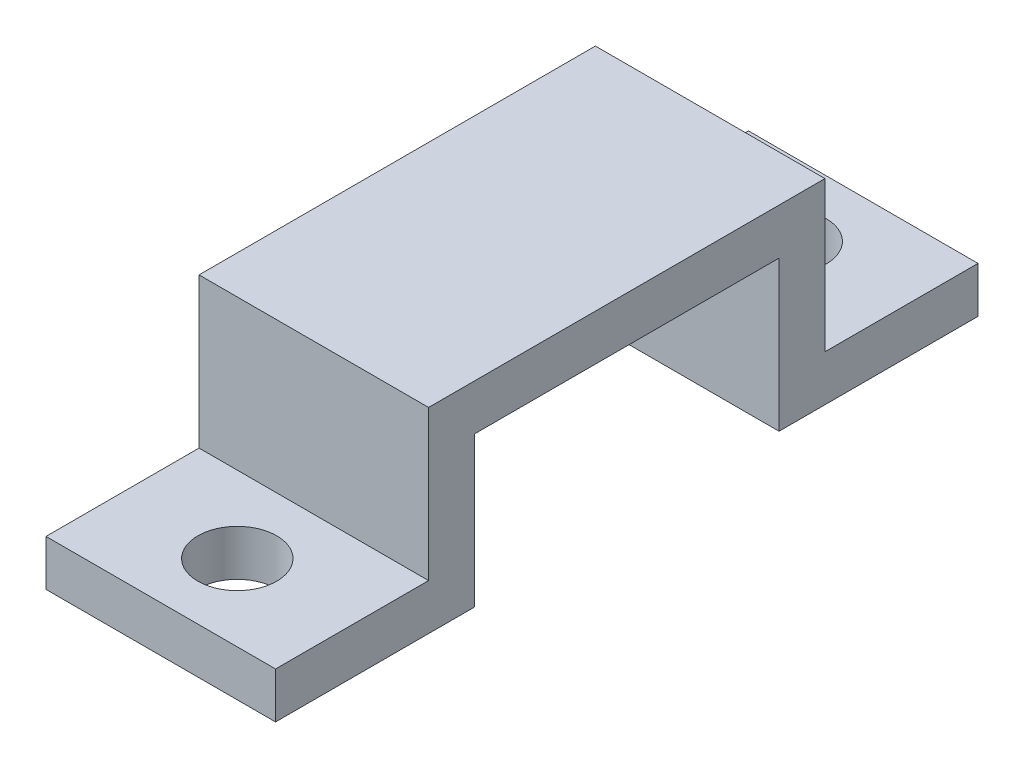
ISO-10303-21;
HEADER;
FILE_DESCRIPTION(('STEP AP214'),'2;1');
FILE_NAME('part.step','',(''),(''),'','','');
FILE_SCHEMA(('AUTOMOTIVE_DESIGN { 1 0 10303 214 1 1 1 1 }'));
ENDSEC;
DATA;
#1=APPLICATION_CONTEXT('core data for automotive mechanical design processes');
#2=APPLICATION_PROTOCOL_DEFINITION('international standard','automotive_design',2000,#1);
#3=PRODUCT_CONTEXT('',#1,'mechanical');
#4=PRODUCT('Part','Part','',(#3));
#5=PRODUCT_RELATED_PRODUCT_CATEGORY('part','',(#4));
#6=PRODUCT_DEFINITION_FORMATION('','',#4);
#7=PRODUCT_DEFINITION_CONTEXT('part definition',#1,'design');
#8=PRODUCT_DEFINITION('design','',#6,#7);
#9=PRODUCT_DEFINITION_SHAPE('','',#8);
#10=(LENGTH_UNIT() NAMED_UNIT(*) SI_UNIT(.MILLI.,.METRE.));
#11=(NAMED_UNIT(*) PLANE_ANGLE_UNIT() SI_UNIT($,.RADIAN.));
#12=(NAMED_UNIT(*) SI_UNIT($,.STERADIAN.) SOLID_ANGLE_UNIT());
#13=UNCERTAINTY_MEASURE_WITH_UNIT(LENGTH_MEASURE(1.E-05),#10,'distance_accuracy_value','');
#14=(GEOMETRIC_REPRESENTATION_CONTEXT(3) GLOBAL_UNCERTAINTY_ASSIGNED_CONTEXT((#13)) GLOBAL_UNIT_ASSIGNED_CONTEXT((#10,
#11,#12)) REPRESENTATION_CONTEXT('',''));
#15=CARTESIAN_POINT('',(0.,0.,0.));
#16=DIRECTION('',(0.,0.,1.));
#17=DIRECTION('',(1.,0.,0.));
#18=AXIS2_PLACEMENT_3D('',#15,#16,#17);
#19=CARTESIAN_POINT('',(15.,-9.8,22.95));
#20=DIRECTION('',(0.,0.,-1.));
#21=DIRECTION('',(-1.,0.,0.));
#22=AXIS2_PLACEMENT_3D('',#19,#20,#21);
#23=PLANE('',#22);
#24=DIRECTION('',(0.,-1.,0.));
#25=VECTOR('',#24,1.);
#26=CARTESIAN_POINT('',(0.,-9.8,22.95));
#27=LINE('',#26,#25);
#28=CARTESIAN_POINT('',(0.,-9.8,22.95));
#29=VERTEX_POINT('',#28);
#30=CARTESIAN_POINT('',(0.,-12.8,22.95));
#31=VERTEX_POINT('',#30);
#32=EDGE_CURVE('E155',#29,#31,#27,.T.);
#33=ORIENTED_EDGE('',*,*,#32,.T.);
#34=DIRECTION('',(-1.,0.,0.));
#35=VECTOR('',#34,1.);
#36=CARTESIAN_POINT('',(15.,-12.8,22.95));
#37=LINE('',#36,#35);
#38=CARTESIAN_POINT('',(15.,-12.8,22.95));
#39=VERTEX_POINT('',#38);
#40=EDGE_CURVE('E11',#39,#31,#37,.T.);
#41=ORIENTED_EDGE('',*,*,#40,.F.);
#42=DIRECTION('',(0.,-1.,0.));
#43=VECTOR('',#42,1.);
#44=CARTESIAN_POINT('',(15.,-9.8,22.95));
#45=LINE('',#44,#43);
#46=CARTESIAN_POINT('',(15.,-9.8,22.95));
#47=VERTEX_POINT('',#46);
#48=EDGE_CURVE('E178',#47,#39,#45,.T.);
#49=ORIENTED_EDGE('',*,*,#48,.F.);
#50=DIRECTION('',(-1.,0.,0.));
#51=VECTOR('',#50,1.);
#52=CARTESIAN_POINT('',(15.,-9.8,22.95));
#53=LINE('',#52,#51);
#54=EDGE_CURVE('E151',#47,#29,#53,.T.);
#55=ORIENTED_EDGE('',*,*,#54,.T.);
#56=EDGE_LOOP('',(#33,#41,#49,#55));
#57=FACE_BOUND('',#56,.T.);
#58=ADVANCED_FACE('F35',(#57),#23,.F.);
#59=CARTESIAN_POINT('',(15.,-12.8,22.95));
#60=DIRECTION('',(0.,1.,0.));
#61=DIRECTION('',(0.,0.,1.));
#62=AXIS2_PLACEMENT_3D('',#59,#60,#61);
#63=PLANE('',#62);
#64=CARTESIAN_POINT('',(7.5,-12.8,17.95));
#65=DIRECTION('',(0.,1.,0.));
#66=DIRECTION('',(0.,0.,1.));
#67=AXIS2_PLACEMENT_3D('',#64,#65,#66);
#68=CIRCLE('',#67,2.575);
#69=CARTESIAN_POINT('',(7.5,-12.8,20.525));
#70=VERTEX_POINT('',#69);
#71=EDGE_CURVE('E159',#70,#70,#68,.T.);
#72=ORIENTED_EDGE('',*,*,#71,.T.);
#73=EDGE_LOOP('',(#72));
#74=FACE_BOUND('',#73,.T.);
#75=DIRECTION('',(0.,0.,-1.));
#76=VECTOR('',#75,1.);
#77=CARTESIAN_POINT('',(0.,-12.8,22.95));
#78=LINE('',#77,#76);
#79=CARTESIAN_POINT('',(0.,-12.8,9.95));
#80=VERTEX_POINT('',#79);
#81=EDGE_CURVE('E158',#31,#80,#78,.T.);
#82=ORIENTED_EDGE('',*,*,#81,.T.);
#83=DIRECTION('',(-1.,0.,0.));
#84=VECTOR('',#83,1.);
#85=CARTESIAN_POINT('',(15.,-12.8,9.95));
#86=LINE('',#85,#84);
#87=CARTESIAN_POINT('',(15.,-12.8,9.95));
#88=VERTEX_POINT('',#87);
#89=EDGE_CURVE('E43',#88,#80,#86,.T.);
#90=ORIENTED_EDGE('',*,*,#89,.F.);
#91=DIRECTION('',(0.,0.,-1.));
#92=VECTOR('',#91,1.);
#93=CARTESIAN_POINT('',(15.,-12.8,22.95));
#94=LINE('',#93,#92);
#95=EDGE_CURVE('E106',#39,#88,#94,.T.);
#96=ORIENTED_EDGE('',*,*,#95,.F.);
#97=ORIENTED_EDGE('',*,*,#40,.T.);
#98=EDGE_LOOP('',(#82,#90,#96,#97));
#99=FACE_BOUND('',#98,.T.);
#100=ADVANCED_FACE('F258',(#74,#99),#63,.F.);
#101=CARTESIAN_POINT('',(15.,-12.8,9.95));
#102=DIRECTION('',(0.,0.,1.));
#103=DIRECTION('',(0.,-1.,0.));
#104=AXIS2_PLACEMENT_3D('',#101,#102,#103);
#105=PLANE('',#104);
#106=DIRECTION('',(0.,1.,0.));
#107=VECTOR('',#106,1.);
#108=CARTESIAN_POINT('',(0.,-12.8,9.95));
#109=LINE('',#108,#107);
#110=CARTESIAN_POINT('',(0.,-3.,9.95));
#111=VERTEX_POINT('',#110);
#112=EDGE_CURVE('E161',#80,#111,#109,.T.);
#113=ORIENTED_EDGE('',*,*,#112,.T.);
#114=DIRECTION('',(-1.,0.,0.));
#115=VECTOR('',#114,1.);
#116=CARTESIAN_POINT('',(15.,-3.,9.95));
#117=LINE('',#116,#115);
#118=CARTESIAN_POINT('',(15.,-3.,9.95));
#119=VERTEX_POINT('',#118);
#120=EDGE_CURVE('E197',#119,#111,#117,.T.);
#121=ORIENTED_EDGE('',*,*,#120,.F.);
#122=DIRECTION('',(0.,1.,0.));
#123=VECTOR('',#122,1.);
#124=CARTESIAN_POINT('',(15.,-12.8,9.95));
#125=LINE('',#124,#123);
#126=EDGE_CURVE('E205',#88,#119,#125,.T.);
#127=ORIENTED_EDGE('',*,*,#126,.F.);
#128=ORIENTED_EDGE('',*,*,#89,.T.);
#129=EDGE_LOOP('',(#113,#121,#127,#128));
#130=FACE_BOUND('',#129,.T.);
#131=ADVANCED_FACE('F203',(#130),#105,.F.);
#132=CARTESIAN_POINT('',(15.,-3.,9.95));
#133=DIRECTION('',(0.,1.,0.));
#134=DIRECTION('',(0.,0.,1.));
#135=AXIS2_PLACEMENT_3D('',#132,#133,#134);
#136=PLANE('',#135);
#137=DIRECTION('',(0.,0.,-1.));
#138=VECTOR('',#137,1.);
#139=CARTESIAN_POINT('',(0.,-3.,9.95));
#140=LINE('',#139,#138);
#141=CARTESIAN_POINT('',(0.,-3.,-9.95));
#142=VERTEX_POINT('',#141);
#143=EDGE_CURVE('E163',#111,#142,#140,.T.);
#144=ORIENTED_EDGE('',*,*,#143,.T.);
#145=DIRECTION('',(-1.,0.,0.));
#146=VECTOR('',#145,1.);
#147=CARTESIAN_POINT('',(15.,-3.,-9.95));
#148=LINE('',#147,#146);
#149=CARTESIAN_POINT('',(15.,-3.,-9.95));
#150=VERTEX_POINT('',#149);
#151=EDGE_CURVE('E194',#150,#142,#148,.T.);
#152=ORIENTED_EDGE('',*,*,#151,.F.);
#153=DIRECTION('',(0.,0.,-1.));
#154=VECTOR('',#153,1.);
#155=CARTESIAN_POINT('',(15.,-3.,9.95));
#156=LINE('',#155,#154);
#157=EDGE_CURVE('E223',#119,#150,#156,.T.);
#158=ORIENTED_EDGE('',*,*,#157,.F.);
#159=ORIENTED_EDGE('',*,*,#120,.T.);
#160=EDGE_LOOP('',(#144,#152,#158,#159));
#161=FACE_BOUND('',#160,.T.);
#162=ADVANCED_FACE('F214',(#161),#136,.F.);
#163=CARTESIAN_POINT('',(15.,-12.8,-9.95));
#164=DIRECTION('',(0.,0.,-1.));
#165=DIRECTION('',(0.,1.,0.));
#166=AXIS2_PLACEMENT_3D('',#163,#164,#165);
#167=PLANE('',#166);
#168=DIRECTION('',(0.,-1.,0.));
#169=VECTOR('',#168,1.);
#170=CARTESIAN_POINT('',(0.,-12.8,-9.95));
#171=LINE('',#170,#169);
#172=CARTESIAN_POINT('',(0.,-12.8,-9.95));
#173=VERTEX_POINT('',#172);
#174=EDGE_CURVE('E165',#142,#173,#171,.T.);
#175=ORIENTED_EDGE('',*,*,#174,.T.);
#176=DIRECTION('',(-1.,0.,0.));
#177=VECTOR('',#176,1.);
#178=CARTESIAN_POINT('',(15.,-12.8,-9.95));
#179=LINE('',#178,#177);
#180=CARTESIAN_POINT('',(15.,-12.8,-9.95));
#181=VERTEX_POINT('',#180);
#182=EDGE_CURVE('E191',#181,#173,#179,.T.);
#183=ORIENTED_EDGE('',*,*,#182,.F.);
#184=DIRECTION('',(0.,-1.,0.));
#185=VECTOR('',#184,1.);
#186=CARTESIAN_POINT('',(15.,-12.8,-9.95));
#187=LINE('',#186,#185);
#188=EDGE_CURVE('E220',#150,#181,#187,.T.);
#189=ORIENTED_EDGE('',*,*,#188,.F.);
#190=ORIENTED_EDGE('',*,*,#151,.T.);
#191=EDGE_LOOP('',(#175,#183,#189,#190));
#192=FACE_BOUND('',#191,.T.);
#193=ADVANCED_FACE('F218',(#192),#167,.F.);
#194=CARTESIAN_POINT('',(15.,-12.8,-22.95));
#195=DIRECTION('',(0.,1.,0.));
#196=DIRECTION('',(0.,0.,1.));
#197=AXIS2_PLACEMENT_3D('',#194,#195,#196);
#198=PLANE('',#197);
#199=CARTESIAN_POINT('',(7.5,-12.8,-17.95));
#200=DIRECTION('',(0.,-1.,0.));
#201=DIRECTION('',(0.,0.,-1.));
#202=AXIS2_PLACEMENT_3D('',#199,#200,#201);
#203=CIRCLE('',#202,2.575);
#204=CARTESIAN_POINT('',(7.5,-12.8,-20.525));
#205=VERTEX_POINT('',#204);
#206=EDGE_CURVE('E360',#205,#205,#203,.T.);
#207=ORIENTED_EDGE('',*,*,#206,.F.);
#208=EDGE_LOOP('',(#207));
#209=FACE_BOUND('',#208,.T.);
#210=DIRECTION('',(0.,0.,-1.));
#211=VECTOR('',#210,1.);
#212=CARTESIAN_POINT('',(0.,-12.8,-22.95));
#213=LINE('',#212,#211);
#214=CARTESIAN_POINT('',(0.,-12.8,-22.95));
#215=VERTEX_POINT('',#214);
#216=EDGE_CURVE('E167',#173,#215,#213,.T.);
#217=ORIENTED_EDGE('',*,*,#216,.T.);
#218=DIRECTION('',(-1.,0.,0.));
#219=VECTOR('',#218,1.);
#220=CARTESIAN_POINT('',(15.,-12.8,-22.95));
#221=LINE('',#220,#219);
#222=CARTESIAN_POINT('',(15.,-12.8,-22.95));
#223=VERTEX_POINT('',#222);
#224=EDGE_CURVE('E188',#223,#215,#221,.T.);
#225=ORIENTED_EDGE('',*,*,#224,.F.);
#226=DIRECTION('',(0.,0.,-1.));
#227=VECTOR('',#226,1.);
#228=CARTESIAN_POINT('',(15.,-12.8,-22.95));
#229=LINE('',#228,#227);
#230=EDGE_CURVE('E222',#181,#223,#229,.T.);
#231=ORIENTED_EDGE('',*,*,#230,.F.);
#232=ORIENTED_EDGE('',*,*,#182,.T.);
#233=EDGE_LOOP('',(#217,#225,#231,#232));
#234=FACE_BOUND('',#233,.T.);
#235=ADVANCED_FACE('F273',(#209,#234),#198,.F.);
#236=CARTESIAN_POINT('',(15.,-9.8,-22.95));
#237=DIRECTION('',(0.,0.,1.));
#238=DIRECTION('',(1.,0.,0.));
#239=AXIS2_PLACEMENT_3D('',#236,#237,#238);
#240=PLANE('',#239);
#241=DIRECTION('',(0.,1.,0.));
#242=VECTOR('',#241,1.);
#243=CARTESIAN_POINT('',(0.,-9.8,-22.95));
#244=LINE('',#243,#242);
#245=CARTESIAN_POINT('',(0.,-9.8,-22.95));
#246=VERTEX_POINT('',#245);
#247=EDGE_CURVE('E169',#215,#246,#244,.T.);
#248=ORIENTED_EDGE('',*,*,#247,.T.);
#249=DIRECTION('',(-1.,0.,0.));
#250=VECTOR('',#249,1.);
#251=CARTESIAN_POINT('',(15.,-9.8,-22.95));
#252=LINE('',#251,#250);
#253=CARTESIAN_POINT('',(15.,-9.8,-22.95));
#254=VERTEX_POINT('',#253);
#255=EDGE_CURVE('E185',#254,#246,#252,.T.);
#256=ORIENTED_EDGE('',*,*,#255,.F.);
#257=DIRECTION('',(0.,1.,0.));
#258=VECTOR('',#257,1.);
#259=CARTESIAN_POINT('',(15.,-9.8,-22.95));
#260=LINE('',#259,#258);
#261=EDGE_CURVE('E225',#223,#254,#260,.T.);
#262=ORIENTED_EDGE('',*,*,#261,.F.);
#263=ORIENTED_EDGE('',*,*,#224,.T.);
#264=EDGE_LOOP('',(#248,#256,#262,#263));
#265=FACE_BOUND('',#264,.T.);
#266=ADVANCED_FACE('F276',(#265),#240,.F.);
#267=CARTESIAN_POINT('',(15.,-9.8,-12.95));
#268=DIRECTION('',(0.,-1.,0.));
#269=DIRECTION('',(0.,0.,-1.));
#270=AXIS2_PLACEMENT_3D('',#267,#268,#269);
#271=PLANE('',#270);
#272=CARTESIAN_POINT('',(7.5,-9.8,-17.95));
#273=DIRECTION('',(0.,-1.,0.));
#274=DIRECTION('',(0.,0.,-1.));
#275=AXIS2_PLACEMENT_3D('',#272,#273,#274);
#276=CIRCLE('',#275,2.575);
#277=CARTESIAN_POINT('',(7.5,-9.8,-20.525));
#278=VERTEX_POINT('',#277);
#279=EDGE_CURVE('E363',#278,#278,#276,.T.);
#280=ORIENTED_EDGE('',*,*,#279,.T.);
#281=EDGE_LOOP('',(#280));
#282=FACE_BOUND('',#281,.T.);
#283=DIRECTION('',(0.,0.,1.));
#284=VECTOR('',#283,1.);
#285=CARTESIAN_POINT('',(0.,-9.8,-12.95));
#286=LINE('',#285,#284);
#287=CARTESIAN_POINT('',(0.,-9.8,-12.95));
#288=VERTEX_POINT('',#287);
#289=EDGE_CURVE('E171',#246,#288,#286,.T.);
#290=ORIENTED_EDGE('',*,*,#289,.T.);
#291=DIRECTION('',(-1.,0.,0.));
#292=VECTOR('',#291,1.);
#293=CARTESIAN_POINT('',(15.,-9.8,-12.95));
#294=LINE('',#293,#292);
#295=CARTESIAN_POINT('',(15.,-9.8,-12.95));
#296=VERTEX_POINT('',#295);
#297=EDGE_CURVE('E182',#296,#288,#294,.T.);
#298=ORIENTED_EDGE('',*,*,#297,.F.);
#299=DIRECTION('',(0.,0.,1.));
#300=VECTOR('',#299,1.);
#301=CARTESIAN_POINT('',(15.,-9.8,-12.95));
#302=LINE('',#301,#300);
#303=EDGE_CURVE('E231',#254,#296,#302,.T.);
#304=ORIENTED_EDGE('',*,*,#303,.F.);
#305=ORIENTED_EDGE('',*,*,#255,.T.);
#306=EDGE_LOOP('',(#290,#298,#304,#305));
#307=FACE_BOUND('',#306,.T.);
#308=ADVANCED_FACE('F237',(#282,#307),#271,.F.);
#309=CARTESIAN_POINT('',(15.,0.,-12.95));
#310=DIRECTION('',(0.,0.,1.));
#311=DIRECTION('',(0.,-1.,0.));
#312=AXIS2_PLACEMENT_3D('',#309,#310,#311);
#313=PLANE('',#312);
#314=DIRECTION('',(0.,1.,0.));
#315=VECTOR('',#314,1.);
#316=CARTESIAN_POINT('',(0.,0.,-12.95));
#317=LINE('',#316,#315);
#318=CARTESIAN_POINT('',(0.,0.,-12.95));
#319=VERTEX_POINT('',#318);
#320=EDGE_CURVE('E173',#288,#319,#317,.T.);
#321=ORIENTED_EDGE('',*,*,#320,.T.);
#322=DIRECTION('',(-1.,0.,0.));
#323=VECTOR('',#322,1.);
#324=CARTESIAN_POINT('',(15.,0.,-12.95));
#325=LINE('',#324,#323);
#326=CARTESIAN_POINT('',(15.,0.,-12.95));
#327=VERTEX_POINT('',#326);
#328=EDGE_CURVE('E146',#327,#319,#325,.T.);
#329=ORIENTED_EDGE('',*,*,#328,.F.);
#330=DIRECTION('',(0.,1.,0.));
#331=VECTOR('',#330,1.);
#332=CARTESIAN_POINT('',(15.,0.,-12.95));
#333=LINE('',#332,#331);
#334=EDGE_CURVE('E137',#296,#327,#333,.T.);
#335=ORIENTED_EDGE('',*,*,#334,.F.);
#336=ORIENTED_EDGE('',*,*,#297,.T.);
#337=EDGE_LOOP('',(#321,#329,#335,#336));
#338=FACE_BOUND('',#337,.T.);
#339=ADVANCED_FACE('F241',(#338),#313,.F.);
#340=CARTESIAN_POINT('',(15.,0.,-12.95));
#341=DIRECTION('',(0.,-1.,0.));
#342=DIRECTION('',(0.,0.,-1.));
#343=AXIS2_PLACEMENT_3D('',#340,#341,#342);
#344=PLANE('',#343);
#345=DIRECTION('',(0.,0.,1.));
#346=VECTOR('',#345,1.);
#347=CARTESIAN_POINT('',(0.,0.,-12.95));
#348=LINE('',#347,#346);
#349=CARTESIAN_POINT('',(0.,0.,12.95));
#350=VERTEX_POINT('',#349);
#351=EDGE_CURVE('E145',#319,#350,#348,.T.);
#352=ORIENTED_EDGE('',*,*,#351,.T.);
#353=DIRECTION('',(-1.,0.,0.));
#354=VECTOR('',#353,1.);
#355=CARTESIAN_POINT('',(15.,0.,12.95));
#356=LINE('',#355,#354);
#357=CARTESIAN_POINT('',(15.,0.,12.95));
#358=VERTEX_POINT('',#357);
#359=EDGE_CURVE('E142',#358,#350,#356,.T.);
#360=ORIENTED_EDGE('',*,*,#359,.F.);
#361=DIRECTION('',(0.,0.,1.));
#362=VECTOR('',#361,1.);
#363=CARTESIAN_POINT('',(15.,0.,-12.95));
#364=LINE('',#363,#362);
#365=EDGE_CURVE('E131',#327,#358,#364,.T.);
#366=ORIENTED_EDGE('',*,*,#365,.F.);
#367=ORIENTED_EDGE('',*,*,#328,.T.);
#368=EDGE_LOOP('',(#352,#360,#366,#367));
#369=FACE_BOUND('',#368,.T.);
#370=ADVANCED_FACE('F143',(#369),#344,.F.);
#371=CARTESIAN_POINT('',(15.,0.,12.95));
#372=DIRECTION('',(0.,0.,-1.));
#373=DIRECTION('',(0.,1.,0.));
#374=AXIS2_PLACEMENT_3D('',#371,#372,#373);
#375=PLANE('',#374);
#376=DIRECTION('',(0.,-1.,0.));
#377=VECTOR('',#376,1.);
#378=CARTESIAN_POINT('',(0.,0.,12.95));
#379=LINE('',#378,#377);
#380=CARTESIAN_POINT('',(0.,-9.8,12.95));
#381=VERTEX_POINT('',#380);
#382=EDGE_CURVE('E92',#350,#381,#379,.T.);
#383=ORIENTED_EDGE('',*,*,#382,.T.);
#384=DIRECTION('',(-1.,0.,0.));
#385=VECTOR('',#384,1.);
#386=CARTESIAN_POINT('',(15.,-9.8,12.95));
#387=LINE('',#386,#385);
#388=CARTESIAN_POINT('',(15.,-9.8,12.95));
#389=VERTEX_POINT('',#388);
#390=EDGE_CURVE('E147',#389,#381,#387,.T.);
#391=ORIENTED_EDGE('',*,*,#390,.F.);
#392=DIRECTION('',(0.,-1.,0.));
#393=VECTOR('',#392,1.);
#394=CARTESIAN_POINT('',(15.,0.,12.95));
#395=LINE('',#394,#393);
#396=EDGE_CURVE('E135',#358,#389,#395,.T.);
#397=ORIENTED_EDGE('',*,*,#396,.F.);
#398=ORIENTED_EDGE('',*,*,#359,.T.);
#399=EDGE_LOOP('',(#383,#391,#397,#398));
#400=FACE_BOUND('',#399,.T.);
#401=ADVANCED_FACE('F149',(#400),#375,.F.);
#402=CARTESIAN_POINT('',(15.,-9.8,12.95));
#403=DIRECTION('',(0.,-1.,0.));
#404=DIRECTION('',(0.,0.,-1.));
#405=AXIS2_PLACEMENT_3D('',#402,#403,#404);
#406=PLANE('',#405);
#407=CARTESIAN_POINT('',(7.5,-9.8,17.95));
#408=DIRECTION('',(0.,1.,0.));
#409=DIRECTION('',(0.,0.,1.));
#410=AXIS2_PLACEMENT_3D('',#407,#408,#409);
#411=CIRCLE('',#410,2.575);
#412=CARTESIAN_POINT('',(7.5,-9.8,20.525));
#413=VERTEX_POINT('',#412);
#414=EDGE_CURVE('E365',#413,#413,#411,.T.);
#415=ORIENTED_EDGE('',*,*,#414,.F.);
#416=EDGE_LOOP('',(#415));
#417=FACE_BOUND('',#416,.T.);
#418=DIRECTION('',(0.,0.,1.));
#419=VECTOR('',#418,1.);
#420=CARTESIAN_POINT('',(0.,-9.8,12.95));
#421=LINE('',#420,#419);
#422=EDGE_CURVE('E98',#381,#29,#421,.T.);
#423=ORIENTED_EDGE('',*,*,#422,.T.);
#424=ORIENTED_EDGE('',*,*,#54,.F.);
#425=DIRECTION('',(0.,0.,1.));
#426=VECTOR('',#425,1.);
#427=CARTESIAN_POINT('',(15.,-9.8,12.95));
#428=LINE('',#427,#426);
#429=EDGE_CURVE('E51',#389,#47,#428,.T.);
#430=ORIENTED_EDGE('',*,*,#429,.F.);
#431=ORIENTED_EDGE('',*,*,#390,.T.);
#432=EDGE_LOOP('',(#423,#424,#430,#431));
#433=FACE_BOUND('',#432,.T.);
#434=ADVANCED_FACE('F245',(#417,#433),#406,.F.);
#435=CARTESIAN_POINT('',(15.,0.,0.));
#436=DIRECTION('',(1.,0.,0.));
#437=DIRECTION('',(0.,0.,-1.));
#438=AXIS2_PLACEMENT_3D('',#435,#436,#437);
#439=PLANE('',#438);
#440=ORIENTED_EDGE('',*,*,#48,.T.);
#441=ORIENTED_EDGE('',*,*,#95,.T.);
#442=ORIENTED_EDGE('',*,*,#126,.T.);
#443=ORIENTED_EDGE('',*,*,#157,.T.);
#444=ORIENTED_EDGE('',*,*,#188,.T.);
#445=ORIENTED_EDGE('',*,*,#230,.T.);
#446=ORIENTED_EDGE('',*,*,#261,.T.);
#447=ORIENTED_EDGE('',*,*,#303,.T.);
#448=ORIENTED_EDGE('',*,*,#334,.T.);
#449=ORIENTED_EDGE('',*,*,#365,.T.);
#450=ORIENTED_EDGE('',*,*,#396,.T.);
#451=ORIENTED_EDGE('',*,*,#429,.T.);
#452=EDGE_LOOP('',(#440,#441,#442,#443,#444,#445,#446,#447,#448,#449,#450,#451));
#453=FACE_BOUND('',#452,.T.);
#454=ADVANCED_FACE('F133',(#453),#439,.T.);
#455=CARTESIAN_POINT('',(0.,0.,0.));
#456=DIRECTION('',(1.,0.,0.));
#457=DIRECTION('',(0.,0.,-1.));
#458=AXIS2_PLACEMENT_3D('',#455,#456,#457);
#459=PLANE('',#458);
#460=ORIENTED_EDGE('',*,*,#32,.F.);
#461=ORIENTED_EDGE('',*,*,#422,.F.);
#462=ORIENTED_EDGE('',*,*,#382,.F.);
#463=ORIENTED_EDGE('',*,*,#351,.F.);
#464=ORIENTED_EDGE('',*,*,#320,.F.);
#465=ORIENTED_EDGE('',*,*,#289,.F.);
#466=ORIENTED_EDGE('',*,*,#247,.F.);
#467=ORIENTED_EDGE('',*,*,#216,.F.);
#468=ORIENTED_EDGE('',*,*,#174,.F.);
#469=ORIENTED_EDGE('',*,*,#143,.F.);
#470=ORIENTED_EDGE('',*,*,#112,.F.);
#471=ORIENTED_EDGE('',*,*,#81,.F.);
#472=EDGE_LOOP('',(#460,#461,#462,#463,#464,#465,#466,#467,#468,#469,#470,#471));
#473=FACE_BOUND('',#472,.T.);
#474=ADVANCED_FACE('F209',(#473),#459,.F.);
#475=CARTESIAN_POINT('',(7.5,-12.8,17.95));
#476=DIRECTION('',(0.,1.,0.));
#477=DIRECTION('',(0.,0.,1.));
#478=AXIS2_PLACEMENT_3D('',#475,#476,#477);
#479=CYLINDRICAL_SURFACE('',#478,2.575);
#480=ORIENTED_EDGE('',*,*,#71,.F.);
#481=EDGE_LOOP('',(#480));
#482=FACE_BOUND('',#481,.T.);
#483=ORIENTED_EDGE('',*,*,#414,.T.);
#484=EDGE_LOOP('',(#483));
#485=FACE_BOUND('',#484,.T.);
#486=ADVANCED_FACE('F310',(#482,#485),#479,.F.);
#487=CARTESIAN_POINT('',(7.5,-12.8,-17.95));
#488=DIRECTION('',(0.,1.,0.));
#489=DIRECTION('',(0.,0.,1.));
#490=AXIS2_PLACEMENT_3D('',#487,#488,#489);
#491=CYLINDRICAL_SURFACE('',#490,2.575);
#492=ORIENTED_EDGE('',*,*,#206,.T.);
#493=EDGE_LOOP('',(#492));
#494=FACE_BOUND('',#493,.T.);
#495=ORIENTED_EDGE('',*,*,#279,.F.);
#496=EDGE_LOOP('',(#495));
#497=FACE_BOUND('',#496,.T.);
#498=ADVANCED_FACE('F328',(#494,#497),#491,.F.);
#499=CLOSED_SHELL('',(#58,#100,#131,#162,#193,#235,#266,#308,#339,#370,#401,#434,#454,#474,#486,#498));
#500=MANIFOLD_SOLID_BREP('B2',#499);
#501=ADVANCED_BREP_SHAPE_REPRESENTATION('',(#18,#500),#14);
#502=SHAPE_DEFINITION_REPRESENTATION(#9,#501);
ENDSEC;
END-ISO-10303-21;
